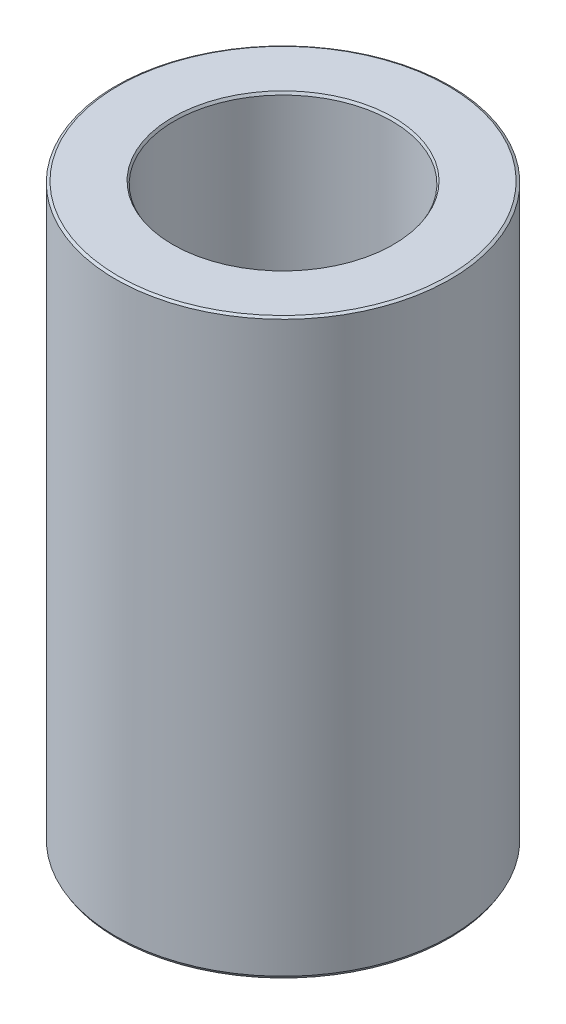
ISO-10303-21;
HEADER;
FILE_DESCRIPTION(('STEP AP214'),'2;1');
FILE_NAME('part.step','',(''),(''),'','','');
FILE_SCHEMA(('AUTOMOTIVE_DESIGN { 1 0 10303 214 1 1 1 1 }'));
ENDSEC;
DATA;
#1=APPLICATION_CONTEXT('core data for automotive mechanical design processes');
#2=APPLICATION_PROTOCOL_DEFINITION('international standard','automotive_design',2000,#1);
#3=PRODUCT_CONTEXT('',#1,'mechanical');
#4=PRODUCT('Part','Part','',(#3));
#5=PRODUCT_RELATED_PRODUCT_CATEGORY('part','',(#4));
#6=PRODUCT_DEFINITION_FORMATION('','',#4);
#7=PRODUCT_DEFINITION_CONTEXT('part definition',#1,'design');
#8=PRODUCT_DEFINITION('design','',#6,#7);
#9=PRODUCT_DEFINITION_SHAPE('','',#8);
#10=(LENGTH_UNIT() NAMED_UNIT(*) SI_UNIT(.MILLI.,.METRE.));
#11=(NAMED_UNIT(*) PLANE_ANGLE_UNIT() SI_UNIT($,.RADIAN.));
#12=(NAMED_UNIT(*) SI_UNIT($,.STERADIAN.) SOLID_ANGLE_UNIT());
#13=UNCERTAINTY_MEASURE_WITH_UNIT(LENGTH_MEASURE(1.E-05),#10,'distance_accuracy_value','');
#14=(GEOMETRIC_REPRESENTATION_CONTEXT(3) GLOBAL_UNCERTAINTY_ASSIGNED_CONTEXT((#13)) GLOBAL_UNIT_ASSIGNED_CONTEXT((#10,
#11,#12)) REPRESENTATION_CONTEXT('',''));
#15=CARTESIAN_POINT('',(0.,0.,0.));
#16=DIRECTION('',(0.,0.,1.));
#17=DIRECTION('',(1.,0.,0.));
#18=AXIS2_PLACEMENT_3D('',#15,#16,#17);
#19=CARTESIAN_POINT('',(0.,171.13371225677,0.));
#20=DIRECTION('',(0.,-1.,0.));
#21=DIRECTION('',(0.,0.,-1.));
#22=AXIS2_PLACEMENT_3D('',#19,#20,#21);
#23=CYLINDRICAL_SURFACE('',#22,50.);
#24=CARTESIAN_POINT('',(0.,0.774264675717506,0.));
#25=DIRECTION('',(0.,1.,0.));
#26=DIRECTION('',(0.,0.,1.));
#27=AXIS2_PLACEMENT_3D('',#24,#25,#26);
#28=CIRCLE('',#27,50.);
#29=CARTESIAN_POINT('',(0.,0.774264675717479,-50.));
#30=VERTEX_POINT('',#29);
#31=EDGE_CURVE('E10',#30,#30,#28,.T.);
#32=CARTESIAN_POINT('',(0.,170.68669033782,0.));
#33=DIRECTION('',(0.,1.,0.));
#34=DIRECTION('',(0.,0.,1.));
#35=AXIS2_PLACEMENT_3D('',#32,#33,#34);
#36=CIRCLE('',#35,50.);
#37=CARTESIAN_POINT('',(0.,170.68669033782,-50.));
#38=VERTEX_POINT('',#37);
#39=EDGE_CURVE('E50',#38,#38,#36,.F.);
#40=CARTESIAN_POINT('',(0.,0.774264675717479,-50.));
#41=CARTESIAN_POINT('',(0.,2.54418577636438,-50.));
#42=CARTESIAN_POINT('',(0.,4.31410687701129,-50.));
#43=CARTESIAN_POINT('',(0.,7.8539490783051,-50.));
#44=CARTESIAN_POINT('',(0.,9.62387017895201,-50.));
#45=CARTESIAN_POINT('',(0.,13.1637123802458,-50.));
#46=CARTESIAN_POINT('',(0.,14.9336334808927,-50.));
#47=CARTESIAN_POINT('',(0.,18.4734756821865,-50.));
#48=CARTESIAN_POINT('',(0.,20.2433967828334,-50.));
#49=CARTESIAN_POINT('',(0.,23.7832389841273,-50.));
#50=CARTESIAN_POINT('',(0.,25.5531600847742,-50.));
#51=CARTESIAN_POINT('',(0.,29.093002286068,-50.));
#52=CARTESIAN_POINT('',(0.,30.8629233867149,-50.));
#53=CARTESIAN_POINT('',(0.,34.4027655880087,-50.));
#54=CARTESIAN_POINT('',(0.,36.1726866886556,-50.));
#55=CARTESIAN_POINT('',(0.,39.7125288899494,-50.));
#56=CARTESIAN_POINT('',(0.,41.4824499905963,-50.));
#57=CARTESIAN_POINT('',(0.,45.0222921918901,-50.));
#58=CARTESIAN_POINT('',(0.,46.792213292537,-50.));
#59=CARTESIAN_POINT('',(0.,50.3320554938308,-50.));
#60=CARTESIAN_POINT('',(0.,52.1019765944777,-50.));
#61=CARTESIAN_POINT('',(0.,55.6418187957715,-50.));
#62=CARTESIAN_POINT('',(0.,57.4117398964185,-50.));
#63=CARTESIAN_POINT('',(0.,60.9515820977123,-50.));
#64=CARTESIAN_POINT('',(0.,62.7215031983592,-50.));
#65=CARTESIAN_POINT('',(0.,66.261345399653,-50.));
#66=CARTESIAN_POINT('',(0.,68.0312665002999,-50.));
#67=CARTESIAN_POINT('',(0.,71.5711087015937,-50.));
#68=CARTESIAN_POINT('',(0.,73.3410298022406,-50.));
#69=CARTESIAN_POINT('',(0.,76.8808720035344,-50.));
#70=CARTESIAN_POINT('',(0.,78.6507931041813,-50.));
#71=CARTESIAN_POINT('',(0.,82.1906353054751,-50.));
#72=CARTESIAN_POINT('',(0.,83.9605564061221,-50.));
#73=CARTESIAN_POINT('',(0.,87.5003986074159,-50.));
#74=CARTESIAN_POINT('',(0.,89.2703197080628,-50.));
#75=CARTESIAN_POINT('',(0.,92.8101619093566,-50.));
#76=CARTESIAN_POINT('',(0.,94.5800830100035,-50.));
#77=CARTESIAN_POINT('',(0.,98.1199252112973,-50.));
#78=CARTESIAN_POINT('',(0.,99.8898463119442,-50.));
#79=CARTESIAN_POINT('',(0.,103.429688513238,-50.));
#80=CARTESIAN_POINT('',(0.,105.199609613885,-50.));
#81=CARTESIAN_POINT('',(0.,108.739451815179,-50.));
#82=CARTESIAN_POINT('',(0.,110.509372915826,-50.));
#83=CARTESIAN_POINT('',(0.,114.049215117119,-50.));
#84=CARTESIAN_POINT('',(0.,115.819136217766,-50.));
#85=CARTESIAN_POINT('',(0.,119.35897841906,-50.));
#86=CARTESIAN_POINT('',(0.,121.128899519707,-50.));
#87=CARTESIAN_POINT('',(0.,124.668741721001,-50.));
#88=CARTESIAN_POINT('',(0.,126.438662821648,-50.));
#89=CARTESIAN_POINT('',(0.,129.978505022942,-50.));
#90=CARTESIAN_POINT('',(0.,131.748426123589,-50.));
#91=CARTESIAN_POINT('',(0.,135.288268324882,-50.));
#92=CARTESIAN_POINT('',(0.,137.058189425529,-50.));
#93=CARTESIAN_POINT('',(0.,140.598031626823,-50.));
#94=CARTESIAN_POINT('',(0.,142.36795272747,-50.));
#95=CARTESIAN_POINT('',(0.,145.907794928764,-50.));
#96=CARTESIAN_POINT('',(0.,147.677716029411,-50.));
#97=CARTESIAN_POINT('',(0.,151.217558230704,-50.));
#98=CARTESIAN_POINT('',(0.,152.987479331351,-50.));
#99=CARTESIAN_POINT('',(0.,156.527321532645,-50.));
#100=CARTESIAN_POINT('',(0.,158.297242633292,-50.));
#101=CARTESIAN_POINT('',(0.,161.837084834586,-50.));
#102=CARTESIAN_POINT('',(0.,163.607005935233,-50.));
#103=CARTESIAN_POINT('',(0.,167.146848136527,-50.));
#104=CARTESIAN_POINT('',(0.,168.916769237174,-50.));
#105=CARTESIAN_POINT('',(0.,170.68669033782,-50.));
#106=B_SPLINE_CURVE_WITH_KNOTS('',3,(#40,#41,#42,#43,#44,#45,#46,#47,#48,#49,#50,#51,#52,#53,
#54,#55,#56,#57,#58,#59,#60,#61,#62,#63,#64,#65,#66,#67,#68,#69,#70,#71,#72,#73,#74,#75,#76,#77,
#78,#79,#80,#81,#82,#83,#84,#85,#86,#87,#88,#89,#90,#91,#92,#93,#94,#95,#96,#97,#98,#99,#100,
#101,#102,#103,#104,#105),.UNSPECIFIED.,.F.,.F.,(4,2,2,2,2,2,2,2,2,2,2,2,2,2,2,2,2,2,2,2,2,2,2,
2,2,2,2,2,2,2,2,2,4),(0.,5.30976330194072,10.6195266038814,15.9292899058222,21.2390532077629,
26.5488165097036,31.8585798116443,37.168343113585,42.4781064155257,47.7878697174664,
53.0976330194072,58.4073963213479,63.7171596232886,69.0269229252293,74.33668622717,
79.6464495291108,84.9562128310515,90.2659761329922,95.5757394349329,100.885502736874,
106.195266038814,111.505029340755,116.814792642696,122.124555944636,127.434319246577,
132.744082548518,138.053845850459,143.363609152399,148.67337245434,153.983135756281,
159.292899058222,164.602662360162,169.912425662103),.UNSPECIFIED.);
#107=EDGE_CURVE('BSEAM39',#30,#38,#106,.T.);
#108=ORIENTED_EDGE('',*,*,#31,.T.);
#109=ORIENTED_EDGE('',*,*,#39,.T.);
#110=ORIENTED_EDGE('',*,*,#107,.T.);
#111=ORIENTED_EDGE('',*,*,#107,.F.);
#112=EDGE_LOOP('',(#108,#110,#109,#111));
#113=FACE_BOUND('',#112,.T.);
#114=ADVANCED_FACE('F39',(#113),#23,.T.);
#115=CARTESIAN_POINT('',(0.,171.13371225677,0.));
#116=DIRECTION('',(0.,1.,0.));
#117=DIRECTION('',(0.,0.,1.));
#118=AXIS2_PLACEMENT_3D('',#115,#116,#117);
#119=PLANE('',#118);
#120=CARTESIAN_POINT('',(0.,171.13371225677,0.));
#121=DIRECTION('',(0.,1.,0.));
#122=DIRECTION('',(0.,0.,1.));
#123=AXIS2_PLACEMENT_3D('',#120,#121,#122);
#124=CIRCLE('',#123,32.9493693351133);
#125=CARTESIAN_POINT('',(0.,171.13371225677,32.9493693351133));
#126=VERTEX_POINT('',#125);
#127=EDGE_CURVE('E58',#126,#126,#124,.F.);
#128=ORIENTED_EDGE('',*,*,#127,.T.);
#129=EDGE_LOOP('',(#128));
#130=FACE_BOUND('',#129,.T.);
#131=CARTESIAN_POINT('',(0.,171.13371225677,0.));
#132=DIRECTION('',(0.,1.,0.));
#133=DIRECTION('',(0.,0.,1.));
#134=AXIS2_PLACEMENT_3D('',#131,#132,#133);
#135=CIRCLE('',#134,49.225735324283);
#136=CARTESIAN_POINT('',(0.,171.13371225677,49.225735324283));
#137=VERTEX_POINT('',#136);
#138=EDGE_CURVE('E61',#137,#137,#135,.T.);
#139=ORIENTED_EDGE('',*,*,#138,.T.);
#140=EDGE_LOOP('',(#139));
#141=FACE_BOUND('',#140,.T.);
#142=ADVANCED_FACE('F88',(#130,#141),#119,.T.);
#143=CARTESIAN_POINT('',(0.,0.,0.));
#144=DIRECTION('',(0.,1.,0.));
#145=DIRECTION('',(0.,0.,1.));
#146=AXIS2_PLACEMENT_3D('',#143,#144,#145);
#147=PLANE('',#146);
#148=CARTESIAN_POINT('',(0.,0.,0.));
#149=DIRECTION('',(0.,1.,0.));
#150=DIRECTION('',(0.,0.,1.));
#151=AXIS2_PLACEMENT_3D('',#148,#149,#150);
#152=CIRCLE('',#151,33.2766120918809);
#153=CARTESIAN_POINT('',(0.,0.,33.2766120918809));
#154=VERTEX_POINT('',#153);
#155=EDGE_CURVE('E51',#154,#154,#152,.T.);
#156=ORIENTED_EDGE('',*,*,#155,.T.);
#157=EDGE_LOOP('',(#156));
#158=FACE_BOUND('',#157,.T.);
#159=CARTESIAN_POINT('',(0.,0.,0.));
#160=DIRECTION('',(0.,1.,0.));
#161=DIRECTION('',(0.,0.,1.));
#162=AXIS2_PLACEMENT_3D('',#159,#160,#161);
#163=CIRCLE('',#162,49.5529780810505);
#164=CARTESIAN_POINT('',(0.,0.,49.5529780810505));
#165=VERTEX_POINT('',#164);
#166=EDGE_CURVE('E54',#165,#165,#163,.F.);
#167=ORIENTED_EDGE('',*,*,#166,.T.);
#168=EDGE_LOOP('',(#167));
#169=FACE_BOUND('',#168,.T.);
#170=ADVANCED_FACE('F83',(#158,#169),#147,.F.);
#171=CARTESIAN_POINT('',(0.,171.13371225677,0.));
#172=DIRECTION('',(0.,-1.,0.));
#173=DIRECTION('',(0.,0.,-1.));
#174=AXIS2_PLACEMENT_3D('',#171,#172,#173);
#175=CYLINDRICAL_SURFACE('',#174,32.5023474161638);
#176=CARTESIAN_POINT('',(0.,170.359447581052,0.));
#177=DIRECTION('',(0.,1.,0.));
#178=DIRECTION('',(0.,0.,1.));
#179=AXIS2_PLACEMENT_3D('',#176,#177,#178);
#180=CIRCLE('',#179,32.5023474161638);
#181=CARTESIAN_POINT('',(0.,170.359447581052,-32.5023474161638));
#182=VERTEX_POINT('',#181);
#183=EDGE_CURVE('E67',#182,#182,#180,.T.);
#184=CARTESIAN_POINT('',(0.,0.44702191894927,0.));
#185=DIRECTION('',(0.,1.,0.));
#186=DIRECTION('',(0.,0.,1.));
#187=AXIS2_PLACEMENT_3D('',#184,#185,#186);
#188=CIRCLE('',#187,32.5023474161638);
#189=CARTESIAN_POINT('',(0.,0.44702191894927,-32.5023474161638));
#190=VERTEX_POINT('',#189);
#191=EDGE_CURVE('E69',#190,#190,#188,.F.);
#192=CARTESIAN_POINT('',(0.,170.359447581052,-32.5023474161638));
#193=CARTESIAN_POINT('',(0.,168.589526480405,-32.5023474161638));
#194=CARTESIAN_POINT('',(0.,166.819605379758,-32.5023474161638));
#195=CARTESIAN_POINT('',(0.,163.279763178465,-32.5023474161638));
#196=CARTESIAN_POINT('',(0.,161.509842077818,-32.5023474161638));
#197=CARTESIAN_POINT('',(0.,157.969999876524,-32.5023474161638));
#198=CARTESIAN_POINT('',(0.,156.200078775877,-32.5023474161638));
#199=CARTESIAN_POINT('',(0.,152.660236574583,-32.5023474161638));
#200=CARTESIAN_POINT('',(0.,150.890315473936,-32.5023474161638));
#201=CARTESIAN_POINT('',(0.,147.350473272642,-32.5023474161638));
#202=CARTESIAN_POINT('',(0.,145.580552171996,-32.5023474161638));
#203=CARTESIAN_POINT('',(0.,142.040709970702,-32.5023474161638));
#204=CARTESIAN_POINT('',(0.,140.270788870055,-32.5023474161638));
#205=CARTESIAN_POINT('',(0.,136.730946668761,-32.5023474161638));
#206=CARTESIAN_POINT('',(0.,134.961025568114,-32.5023474161638));
#207=CARTESIAN_POINT('',(0.,131.42118336682,-32.5023474161638));
#208=CARTESIAN_POINT('',(0.,129.651262266173,-32.5023474161638));
#209=CARTESIAN_POINT('',(0.,126.11142006488,-32.5023474161638));
#210=CARTESIAN_POINT('',(0.,124.341498964233,-32.5023474161638));
#211=CARTESIAN_POINT('',(0.,120.801656762939,-32.5023474161638));
#212=CARTESIAN_POINT('',(0.,119.031735662292,-32.5023474161638));
#213=CARTESIAN_POINT('',(0.,115.491893460998,-32.5023474161638));
#214=CARTESIAN_POINT('',(0.,113.721972360351,-32.5023474161638));
#215=CARTESIAN_POINT('',(0.,110.182130159057,-32.5023474161638));
#216=CARTESIAN_POINT('',(0.,108.412209058411,-32.5023474161638));
#217=CARTESIAN_POINT('',(0.,104.872366857117,-32.5023474161638));
#218=CARTESIAN_POINT('',(0.,103.10244575647,-32.5023474161638));
#219=CARTESIAN_POINT('',(0.,99.562603555176,-32.5023474161638));
#220=CARTESIAN_POINT('',(0.,97.7926824545291,-32.5023474161638));
#221=CARTESIAN_POINT('',(0.,94.2528402532353,-32.5023474161638));
#222=CARTESIAN_POINT('',(0.,92.4829191525884,-32.5023474161638));
#223=CARTESIAN_POINT('',(0.,88.9430769512946,-32.5023474161638));
#224=CARTESIAN_POINT('',(0.,87.1731558506477,-32.5023474161638));
#225=CARTESIAN_POINT('',(0.,83.6333136493539,-32.5023474161638));
#226=CARTESIAN_POINT('',(0.,81.863392548707,-32.5023474161638));
#227=CARTESIAN_POINT('',(0.,78.3235503474132,-32.5023474161638));
#228=CARTESIAN_POINT('',(0.,76.5536292467662,-32.5023474161638));
#229=CARTESIAN_POINT('',(0.,73.0137870454724,-32.5023474161638));
#230=CARTESIAN_POINT('',(0.,71.2438659448255,-32.5023474161638));
#231=CARTESIAN_POINT('',(0.,67.7040237435317,-32.5023474161638));
#232=CARTESIAN_POINT('',(0.,65.9341026428848,-32.5023474161638));
#233=CARTESIAN_POINT('',(0.,62.394260441591,-32.5023474161638));
#234=CARTESIAN_POINT('',(0.,60.6243393409441,-32.5023474161638));
#235=CARTESIAN_POINT('',(0.,57.0844971396503,-32.5023474161638));
#236=CARTESIAN_POINT('',(0.,55.3145760390034,-32.5023474161638));
#237=CARTESIAN_POINT('',(0.,51.7747338377095,-32.5023474161638));
#238=CARTESIAN_POINT('',(0.,50.0048127370627,-32.5023474161638));
#239=CARTESIAN_POINT('',(0.,46.4649705357688,-32.5023474161638));
#240=CARTESIAN_POINT('',(0.,44.6950494351219,-32.5023474161638));
#241=CARTESIAN_POINT('',(0.,41.1552072338281,-32.5023474161638));
#242=CARTESIAN_POINT('',(0.,39.3852861331812,-32.5023474161638));
#243=CARTESIAN_POINT('',(0.,35.8454439318874,-32.5023474161638));
#244=CARTESIAN_POINT('',(0.,34.0755228312405,-32.5023474161638));
#245=CARTESIAN_POINT('',(0.,30.5356806299467,-32.5023474161638));
#246=CARTESIAN_POINT('',(0.,28.7657595292998,-32.5023474161638));
#247=CARTESIAN_POINT('',(0.,25.225917328006,-32.5023474161638));
#248=CARTESIAN_POINT('',(0.,23.455996227359,-32.5023474161638));
#249=CARTESIAN_POINT('',(0.,19.9161540260652,-32.5023474161638));
#250=CARTESIAN_POINT('',(0.,18.1462329254183,-32.5023474161638));
#251=CARTESIAN_POINT('',(0.,14.6063907241245,-32.5023474161638));
#252=CARTESIAN_POINT('',(0.,12.8364696234776,-32.5023474161638));
#253=CARTESIAN_POINT('',(0.,9.2966274221838,-32.5023474161638));
#254=CARTESIAN_POINT('',(0.,7.52670632153689,-32.5023474161638));
#255=CARTESIAN_POINT('',(0.,3.98686412024308,-32.5023474161638));
#256=CARTESIAN_POINT('',(0.,2.21694301959618,-32.5023474161638));
#257=CARTESIAN_POINT('',(0.,0.44702191894927,-32.5023474161638));
#258=B_SPLINE_CURVE_WITH_KNOTS('',3,(#192,#193,#194,#195,#196,#197,#198,#199,#200,#201,#202,
#203,#204,#205,#206,#207,#208,#209,#210,#211,#212,#213,#214,#215,#216,#217,#218,#219,#220,#221,
#222,#223,#224,#225,#226,#227,#228,#229,#230,#231,#232,#233,#234,#235,#236,#237,#238,#239,#240,
#241,#242,#243,#244,#245,#246,#247,#248,#249,#250,#251,#252,#253,#254,#255,#256,#257),
.UNSPECIFIED.,.F.,.F.,(4,2,2,2,2,2,2,2,2,2,2,2,2,2,2,2,2,2,2,2,2,2,2,2,2,2,2,2,2,2,2,2,4),(0.,
5.30976330194075,10.6195266038815,15.9292899058222,21.2390532077629,26.5488165097036,
31.8585798116443,37.1683431135851,42.4781064155258,47.7878697174665,53.0976330194072,
58.4073963213479,63.7171596232886,69.0269229252294,74.3366862271701,79.6464495291108,
84.9562128310515,90.2659761329922,95.5757394349329,100.885502736874,106.195266038814,
111.505029340755,116.814792642696,122.124555944637,127.434319246577,132.744082548518,
138.053845850459,143.363609152399,148.67337245434,153.983135756281,159.292899058222,
164.602662360162,169.912425662103),.UNSPECIFIED.);
#259=EDGE_CURVE('BSEAM71',#182,#190,#258,.T.);
#260=ORIENTED_EDGE('',*,*,#183,.T.);
#261=ORIENTED_EDGE('',*,*,#191,.T.);
#262=ORIENTED_EDGE('',*,*,#259,.T.);
#263=ORIENTED_EDGE('',*,*,#259,.F.);
#264=EDGE_LOOP('',(#260,#262,#261,#263));
#265=FACE_BOUND('',#264,.T.);
#266=ADVANCED_FACE('F71',(#265),#175,.F.);
#267=CARTESIAN_POINT('',(0.,170.359447581052,0.));
#268=DIRECTION('',(0.,1.,0.));
#269=DIRECTION('',(0.,0.,1.));
#270=AXIS2_PLACEMENT_3D('',#267,#268,#269);
#271=CONICAL_SURFACE('',#270,32.5023474161638,0.523598775598284);
#272=ORIENTED_EDGE('',*,*,#127,.F.);
#273=EDGE_LOOP('',(#272));
#274=FACE_BOUND('',#273,.T.);
#275=ORIENTED_EDGE('',*,*,#183,.F.);
#276=EDGE_LOOP('',(#275));
#277=FACE_BOUND('',#276,.T.);
#278=ADVANCED_FACE('F77',(#274,#277),#271,.F.);
#279=CARTESIAN_POINT('',(0.,0.,0.));
#280=DIRECTION('',(0.,-1.,0.));
#281=DIRECTION('',(0.,0.,-1.));
#282=AXIS2_PLACEMENT_3D('',#279,#280,#281);
#283=CONICAL_SURFACE('',#282,33.2766120918809,1.0471975511966);
#284=ORIENTED_EDGE('',*,*,#191,.F.);
#285=EDGE_LOOP('',(#284));
#286=FACE_BOUND('',#285,.T.);
#287=ORIENTED_EDGE('',*,*,#155,.F.);
#288=EDGE_LOOP('',(#287));
#289=FACE_BOUND('',#288,.T.);
#290=ADVANCED_FACE('F73',(#286,#289),#283,.F.);
#291=CARTESIAN_POINT('',(0.,0.774264675717506,0.));
#292=DIRECTION('',(0.,1.,0.));
#293=DIRECTION('',(0.,0.,1.));
#294=AXIS2_PLACEMENT_3D('',#291,#292,#293);
#295=CONICAL_SURFACE('',#294,50.,0.523598775598304);
#296=ORIENTED_EDGE('',*,*,#166,.F.);
#297=EDGE_LOOP('',(#296));
#298=FACE_BOUND('',#297,.T.);
#299=ORIENTED_EDGE('',*,*,#31,.F.);
#300=EDGE_LOOP('',(#299));
#301=FACE_BOUND('',#300,.T.);
#302=ADVANCED_FACE('F76',(#298,#301),#295,.T.);
#303=CARTESIAN_POINT('',(0.,171.13371225677,0.));
#304=DIRECTION('',(0.,-1.,0.));
#305=DIRECTION('',(0.,0.,-1.));
#306=AXIS2_PLACEMENT_3D('',#303,#304,#305);
#307=CONICAL_SURFACE('',#306,49.225735324283,1.0471975511966);
#308=ORIENTED_EDGE('',*,*,#39,.F.);
#309=EDGE_LOOP('',(#308));
#310=FACE_BOUND('',#309,.T.);
#311=ORIENTED_EDGE('',*,*,#138,.F.);
#312=EDGE_LOOP('',(#311));
#313=FACE_BOUND('',#312,.T.);
#314=ADVANCED_FACE('F45',(#310,#313),#307,.T.);
#315=CLOSED_SHELL('',(#114,#142,#170,#266,#278,#290,#302,#314));
#316=MANIFOLD_SOLID_BREP('B2',#315);
#317=ADVANCED_BREP_SHAPE_REPRESENTATION('',(#18,#316),#14);
#318=SHAPE_DEFINITION_REPRESENTATION(#9,#317);
ENDSEC;
END-ISO-10303-21;
